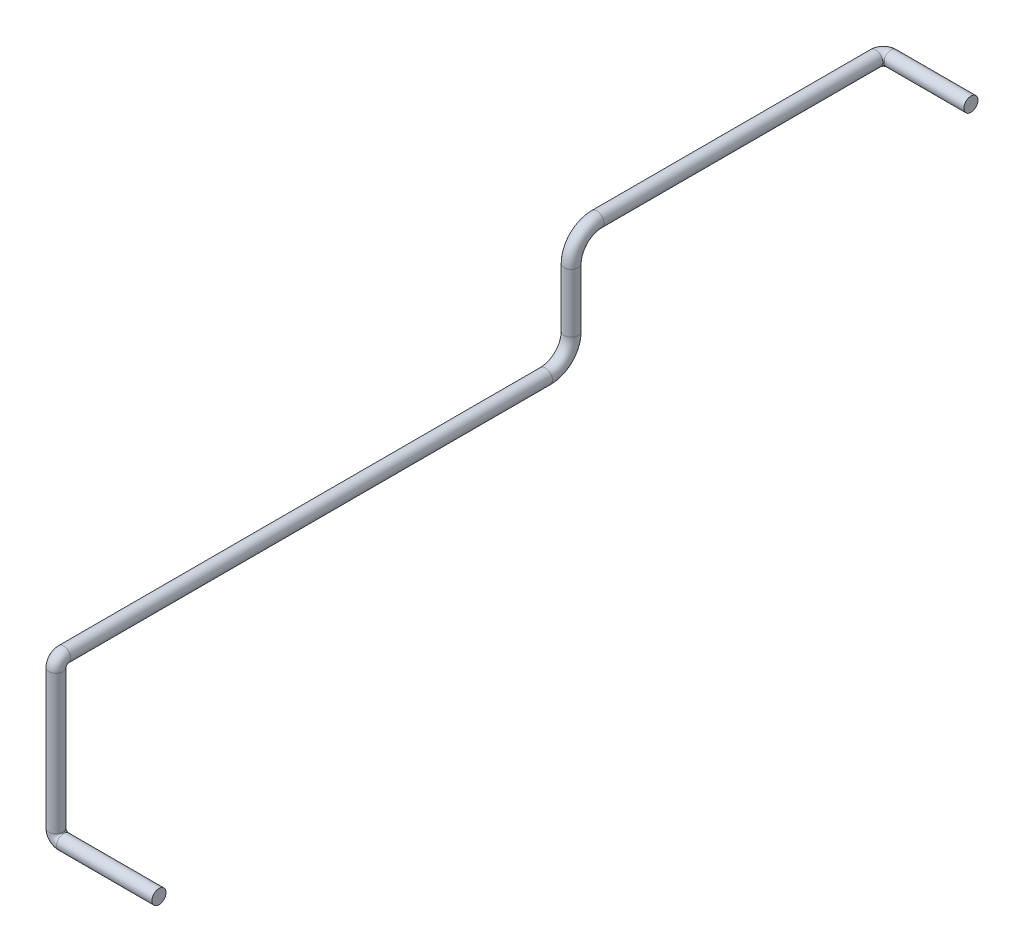
ISO-10303-21;
HEADER;
FILE_DESCRIPTION(('STEP AP214'),'2;1');
FILE_NAME('part.step','',(''),(''),'','','');
FILE_SCHEMA(('AUTOMOTIVE_DESIGN { 1 0 10303 214 1 1 1 1 }'));
ENDSEC;
DATA;
#1=APPLICATION_CONTEXT('core data for automotive mechanical design processes');
#2=APPLICATION_PROTOCOL_DEFINITION('international standard','automotive_design',2000,#1);
#3=PRODUCT_CONTEXT('',#1,'mechanical');
#4=PRODUCT('Part','Part','',(#3));
#5=PRODUCT_RELATED_PRODUCT_CATEGORY('part','',(#4));
#6=PRODUCT_DEFINITION_FORMATION('','',#4);
#7=PRODUCT_DEFINITION_CONTEXT('part definition',#1,'design');
#8=PRODUCT_DEFINITION('design','',#6,#7);
#9=PRODUCT_DEFINITION_SHAPE('','',#8);
#10=(LENGTH_UNIT() NAMED_UNIT(*) SI_UNIT(.MILLI.,.METRE.));
#11=(NAMED_UNIT(*) PLANE_ANGLE_UNIT() SI_UNIT($,.RADIAN.));
#12=(NAMED_UNIT(*) SI_UNIT($,.STERADIAN.) SOLID_ANGLE_UNIT());
#13=UNCERTAINTY_MEASURE_WITH_UNIT(LENGTH_MEASURE(1.E-05),#10,'distance_accuracy_value','');
#14=(GEOMETRIC_REPRESENTATION_CONTEXT(3) GLOBAL_UNCERTAINTY_ASSIGNED_CONTEXT((#13)) GLOBAL_UNIT_ASSIGNED_CONTEXT((#10,
#11,#12)) REPRESENTATION_CONTEXT('',''));
#15=CARTESIAN_POINT('',(0.,0.,0.));
#16=DIRECTION('',(0.,0.,1.));
#17=DIRECTION('',(1.,0.,0.));
#18=AXIS2_PLACEMENT_3D('',#15,#16,#17);
#19=CARTESIAN_POINT('',(0.,0.,0.));
#20=DIRECTION('',(1.,0.,0.));
#21=DIRECTION('',(0.,0.,-1.));
#22=AXIS2_PLACEMENT_3D('',#19,#20,#21);
#23=PLANE('',#22);
#24=CARTESIAN_POINT('',(0.,0.,0.));
#25=DIRECTION('',(1.,0.,0.));
#26=DIRECTION('',(0.,0.,-1.));
#27=AXIS2_PLACEMENT_3D('',#24,#25,#26);
#28=CIRCLE('',#27,13.7);
#29=CARTESIAN_POINT('',(0.,0.,-13.7));
#30=VERTEX_POINT('',#29);
#31=EDGE_CURVE('E49',#30,#30,#28,.T.);
#32=ORIENTED_EDGE('',*,*,#31,.T.);
#33=EDGE_LOOP('',(#32));
#34=FACE_BOUND('',#33,.T.);
#35=ADVANCED_FACE('F37',(#34),#23,.T.);
#36=CARTESIAN_POINT('',(-29.9999999999999,514.000000000001,-1606.));
#37=DIRECTION('',(-1.,0.,0.));
#38=DIRECTION('',(0.,-1.,0.));
#39=AXIS2_PLACEMENT_3D('',#36,#37,#38);
#40=PLANE('',#39);
#41=CARTESIAN_POINT('',(-29.9999999999999,514.000000000001,-1606.));
#42=DIRECTION('',(-1.,0.,0.));
#43=DIRECTION('',(0.,-1.,0.));
#44=AXIS2_PLACEMENT_3D('',#41,#42,#43);
#45=CIRCLE('',#44,13.7);
#46=CARTESIAN_POINT('',(-29.9999999999999,500.300000000001,-1606.));
#47=VERTEX_POINT('',#46);
#48=EDGE_CURVE('E11',#47,#47,#45,.T.);
#49=ORIENTED_EDGE('',*,*,#48,.F.);
#50=EDGE_LOOP('',(#49));
#51=FACE_BOUND('',#50,.T.);
#52=ADVANCED_FACE('F55',(#51),#40,.F.);
#53=CARTESIAN_POINT('',(0.,0.,0.));
#54=DIRECTION('',(-1.,0.,0.));
#55=DIRECTION('',(0.,0.,1.));
#56=AXIS2_PLACEMENT_3D('',#53,#54,#55);
#57=CYLINDRICAL_SURFACE('',#56,13.7);
#58=CARTESIAN_POINT('',(-185.,0.,0.));
#59=DIRECTION('',(1.,0.,0.));
#60=DIRECTION('',(0.,0.,-1.));
#61=AXIS2_PLACEMENT_3D('',#58,#59,#60);
#62=CIRCLE('',#61,13.7);
#63=CARTESIAN_POINT('',(-185.,-13.7,0.));
#64=VERTEX_POINT('',#63);
#65=EDGE_CURVE('E113',#64,#64,#62,.T.);
#66=ORIENTED_EDGE('',*,*,#65,.T.);
#67=EDGE_LOOP('',(#66));
#68=FACE_BOUND('',#67,.T.);
#69=ORIENTED_EDGE('',*,*,#31,.F.);
#70=EDGE_LOOP('',(#69));
#71=FACE_BOUND('',#70,.T.);
#72=ADVANCED_FACE('F57',(#68,#71),#57,.T.);
#73=CARTESIAN_POINT('',(-185.,15.,0.));
#74=DIRECTION('',(0.,0.,-1.));
#75=DIRECTION('',(-1.,0.,0.));
#76=AXIS2_PLACEMENT_3D('',#73,#74,#75);
#77=TOROIDAL_SURFACE('',#76,15.,13.7);
#78=CARTESIAN_POINT('',(-200.,15.,0.));
#79=DIRECTION('',(0.,-1.,0.));
#80=DIRECTION('',(0.,0.,-1.));
#81=AXIS2_PLACEMENT_3D('',#78,#79,#80);
#82=CIRCLE('',#81,13.7);
#83=CARTESIAN_POINT('',(-213.7,15.,0.));
#84=VERTEX_POINT('',#83);
#85=EDGE_CURVE('E110',#84,#84,#82,.T.);
#86=CARTESIAN_POINT('',(-185.,15.,0.));
#87=DIRECTION('',(0.,0.,-1.));
#88=DIRECTION('',(-1.,0.,0.));
#89=AXIS2_PLACEMENT_3D('',#86,#87,#88);
#90=CIRCLE('',#89,28.7);
#91=EDGE_CURVE('',#64,#84,#90,.T.);
#92=ORIENTED_EDGE('',*,*,#65,.F.);
#93=ORIENTED_EDGE('',*,*,#85,.T.);
#94=ORIENTED_EDGE('',*,*,#91,.T.);
#95=ORIENTED_EDGE('',*,*,#91,.F.);
#96=EDGE_LOOP('',(#92,#94,#93,#95));
#97=FACE_BOUND('',#96,.T.);
#98=ADVANCED_FACE('F62',(#97),#77,.T.);
#99=CARTESIAN_POINT('',(-200.,15.,0.));
#100=DIRECTION('',(0.,1.,0.));
#101=DIRECTION('',(0.,0.,1.));
#102=AXIS2_PLACEMENT_3D('',#99,#100,#101);
#103=CYLINDRICAL_SURFACE('',#102,13.7);
#104=CARTESIAN_POINT('',(-200.,285.,0.));
#105=DIRECTION('',(0.,-1.,0.));
#106=DIRECTION('',(0.,0.,-1.));
#107=AXIS2_PLACEMENT_3D('',#104,#105,#106);
#108=CIRCLE('',#107,13.7);
#109=CARTESIAN_POINT('',(-200.,285.,13.7));
#110=VERTEX_POINT('',#109);
#111=EDGE_CURVE('E115',#110,#110,#108,.T.);
#112=ORIENTED_EDGE('',*,*,#111,.T.);
#113=EDGE_LOOP('',(#112));
#114=FACE_BOUND('',#113,.T.);
#115=ORIENTED_EDGE('',*,*,#85,.F.);
#116=EDGE_LOOP('',(#115));
#117=FACE_BOUND('',#116,.T.);
#118=ADVANCED_FACE('F98',(#114,#117),#103,.T.);
#119=CARTESIAN_POINT('',(-200.,285.,-15.));
#120=DIRECTION('',(-1.,0.,0.));
#121=DIRECTION('',(0.,0.,1.));
#122=AXIS2_PLACEMENT_3D('',#119,#120,#121);
#123=TOROIDAL_SURFACE('',#122,15.,13.7);
#124=CARTESIAN_POINT('',(-200.,300.,-15.));
#125=DIRECTION('',(0.,0.,1.));
#126=DIRECTION('',(0.,-1.,0.));
#127=AXIS2_PLACEMENT_3D('',#124,#125,#126);
#128=CIRCLE('',#127,13.7);
#129=CARTESIAN_POINT('',(-200.,313.7,-15.));
#130=VERTEX_POINT('',#129);
#131=EDGE_CURVE('E121',#130,#130,#128,.T.);
#132=CARTESIAN_POINT('',(-200.,285.,-15.));
#133=DIRECTION('',(-1.,0.,0.));
#134=DIRECTION('',(0.,0.,1.));
#135=AXIS2_PLACEMENT_3D('',#132,#133,#134);
#136=CIRCLE('',#135,28.7);
#137=EDGE_CURVE('',#110,#130,#136,.T.);
#138=ORIENTED_EDGE('',*,*,#111,.F.);
#139=ORIENTED_EDGE('',*,*,#131,.T.);
#140=ORIENTED_EDGE('',*,*,#137,.T.);
#141=ORIENTED_EDGE('',*,*,#137,.F.);
#142=EDGE_LOOP('',(#138,#140,#139,#141));
#143=FACE_BOUND('',#142,.T.);
#144=ADVANCED_FACE('F94',(#143),#123,.T.);
#145=CARTESIAN_POINT('',(-200.,300.,-15.));
#146=DIRECTION('',(0.,0.,-1.));
#147=DIRECTION('',(0.,1.,0.));
#148=AXIS2_PLACEMENT_3D('',#145,#146,#147);
#149=CYLINDRICAL_SURFACE('',#148,13.7);
#150=CARTESIAN_POINT('',(-200.,300.,-950.));
#151=DIRECTION('',(0.,0.,1.));
#152=DIRECTION('',(0.,-1.,0.));
#153=AXIS2_PLACEMENT_3D('',#150,#151,#152);
#154=CIRCLE('',#153,13.7);
#155=CARTESIAN_POINT('',(-200.,286.3,-950.));
#156=VERTEX_POINT('',#155);
#157=EDGE_CURVE('E124',#156,#156,#154,.T.);
#158=ORIENTED_EDGE('',*,*,#157,.T.);
#159=EDGE_LOOP('',(#158));
#160=FACE_BOUND('',#159,.T.);
#161=ORIENTED_EDGE('',*,*,#131,.F.);
#162=EDGE_LOOP('',(#161));
#163=FACE_BOUND('',#162,.T.);
#164=ADVANCED_FACE('F90',(#160,#163),#149,.T.);
#165=CARTESIAN_POINT('',(-200.,350.,-950.));
#166=DIRECTION('',(1.,0.,0.));
#167=DIRECTION('',(0.,0.,-1.));
#168=AXIS2_PLACEMENT_3D('',#165,#166,#167);
#169=TOROIDAL_SURFACE('',#168,50.,13.7);
#170=CARTESIAN_POINT('',(-200.,350.,-1000.));
#171=DIRECTION('',(0.,-1.,0.));
#172=DIRECTION('',(0.,0.,-1.));
#173=AXIS2_PLACEMENT_3D('',#170,#171,#172);
#174=CIRCLE('',#173,13.7);
#175=CARTESIAN_POINT('',(-200.,350.,-1013.7));
#176=VERTEX_POINT('',#175);
#177=EDGE_CURVE('E127',#176,#176,#174,.T.);
#178=CARTESIAN_POINT('',(-200.,350.,-950.));
#179=DIRECTION('',(1.,0.,0.));
#180=DIRECTION('',(0.,0.,-1.));
#181=AXIS2_PLACEMENT_3D('',#178,#179,#180);
#182=CIRCLE('',#181,63.7);
#183=EDGE_CURVE('',#156,#176,#182,.T.);
#184=ORIENTED_EDGE('',*,*,#157,.F.);
#185=ORIENTED_EDGE('',*,*,#177,.T.);
#186=ORIENTED_EDGE('',*,*,#183,.T.);
#187=ORIENTED_EDGE('',*,*,#183,.F.);
#188=EDGE_LOOP('',(#184,#186,#185,#187));
#189=FACE_BOUND('',#188,.T.);
#190=ADVANCED_FACE('F86',(#189),#169,.T.);
#191=CARTESIAN_POINT('',(-200.,350.,-1000.));
#192=DIRECTION('',(0.,1.,0.));
#193=DIRECTION('',(0.,0.,1.));
#194=AXIS2_PLACEMENT_3D('',#191,#192,#193);
#195=CYLINDRICAL_SURFACE('',#194,13.7);
#196=CARTESIAN_POINT('',(-200.,464.,-1000.));
#197=DIRECTION('',(0.,-1.,0.));
#198=DIRECTION('',(0.,0.,-1.));
#199=AXIS2_PLACEMENT_3D('',#196,#197,#198);
#200=CIRCLE('',#199,13.7);
#201=CARTESIAN_POINT('',(-200.,464.,-986.3));
#202=VERTEX_POINT('',#201);
#203=EDGE_CURVE('E130',#202,#202,#200,.T.);
#204=ORIENTED_EDGE('',*,*,#203,.T.);
#205=EDGE_LOOP('',(#204));
#206=FACE_BOUND('',#205,.T.);
#207=ORIENTED_EDGE('',*,*,#177,.F.);
#208=EDGE_LOOP('',(#207));
#209=FACE_BOUND('',#208,.T.);
#210=ADVANCED_FACE('F82',(#206,#209),#195,.T.);
#211=CARTESIAN_POINT('',(-200.,464.,-1050.));
#212=DIRECTION('',(-1.,0.,0.));
#213=DIRECTION('',(0.,0.,1.));
#214=AXIS2_PLACEMENT_3D('',#211,#212,#213);
#215=TOROIDAL_SURFACE('',#214,50.,13.7);
#216=CARTESIAN_POINT('',(-200.,514.,-1050.));
#217=DIRECTION('',(0.,0.,1.));
#218=DIRECTION('',(0.,-1.,0.));
#219=AXIS2_PLACEMENT_3D('',#216,#217,#218);
#220=CIRCLE('',#219,13.7);
#221=CARTESIAN_POINT('',(-200.,527.7,-1050.));
#222=VERTEX_POINT('',#221);
#223=EDGE_CURVE('E133',#222,#222,#220,.T.);
#224=CARTESIAN_POINT('',(-200.,464.,-1050.));
#225=DIRECTION('',(-1.,0.,0.));
#226=DIRECTION('',(0.,0.,1.));
#227=AXIS2_PLACEMENT_3D('',#224,#225,#226);
#228=CIRCLE('',#227,63.7);
#229=EDGE_CURVE('',#202,#222,#228,.T.);
#230=ORIENTED_EDGE('',*,*,#203,.F.);
#231=ORIENTED_EDGE('',*,*,#223,.T.);
#232=ORIENTED_EDGE('',*,*,#229,.T.);
#233=ORIENTED_EDGE('',*,*,#229,.F.);
#234=EDGE_LOOP('',(#230,#232,#231,#233));
#235=FACE_BOUND('',#234,.T.);
#236=ADVANCED_FACE('F78',(#235),#215,.T.);
#237=CARTESIAN_POINT('',(-200.,514.,-1050.));
#238=DIRECTION('',(0.,0.,-1.));
#239=DIRECTION('',(0.,1.,0.));
#240=AXIS2_PLACEMENT_3D('',#237,#238,#239);
#241=CYLINDRICAL_SURFACE('',#240,13.7);
#242=CARTESIAN_POINT('',(-200.,514.000000000001,-1591.));
#243=DIRECTION('',(0.,0.,1.));
#244=DIRECTION('',(0.,-1.,0.));
#245=AXIS2_PLACEMENT_3D('',#242,#243,#244);
#246=CIRCLE('',#245,13.7);
#247=CARTESIAN_POINT('',(-213.7,514.000000000001,-1591.));
#248=VERTEX_POINT('',#247);
#249=EDGE_CURVE('E136',#248,#248,#246,.T.);
#250=ORIENTED_EDGE('',*,*,#249,.T.);
#251=EDGE_LOOP('',(#250));
#252=FACE_BOUND('',#251,.T.);
#253=ORIENTED_EDGE('',*,*,#223,.F.);
#254=EDGE_LOOP('',(#253));
#255=FACE_BOUND('',#254,.T.);
#256=ADVANCED_FACE('F72',(#252,#255),#241,.T.);
#257=CARTESIAN_POINT('',(-185.,514.,-1591.));
#258=DIRECTION('',(0.,-1.,0.));
#259=DIRECTION('',(0.,0.,-1.));
#260=AXIS2_PLACEMENT_3D('',#257,#258,#259);
#261=TOROIDAL_SURFACE('',#260,14.9999999999999,13.7);
#262=CARTESIAN_POINT('',(-185.,514.,-1606.));
#263=DIRECTION('',(-1.,0.,0.));
#264=DIRECTION('',(0.,-1.,0.));
#265=AXIS2_PLACEMENT_3D('',#262,#263,#264);
#266=CIRCLE('',#265,13.7);
#267=CARTESIAN_POINT('',(-185.,514.,-1619.7));
#268=VERTEX_POINT('',#267);
#269=EDGE_CURVE('E44',#268,#268,#266,.T.);
#270=CARTESIAN_POINT('',(-185.,514.,-1591.));
#271=DIRECTION('',(0.,-1.,0.));
#272=DIRECTION('',(0.,0.,-1.));
#273=AXIS2_PLACEMENT_3D('',#270,#271,#272);
#274=CIRCLE('',#273,28.6999999999999);
#275=EDGE_CURVE('',#248,#268,#274,.T.);
#276=ORIENTED_EDGE('',*,*,#249,.F.);
#277=ORIENTED_EDGE('',*,*,#269,.T.);
#278=ORIENTED_EDGE('',*,*,#275,.T.);
#279=ORIENTED_EDGE('',*,*,#275,.F.);
#280=EDGE_LOOP('',(#276,#278,#277,#279));
#281=FACE_BOUND('',#280,.T.);
#282=ADVANCED_FACE('F68',(#281),#261,.T.);
#283=CARTESIAN_POINT('',(-185.,514.000000000001,-1606.));
#284=DIRECTION('',(1.,0.,0.));
#285=DIRECTION('',(0.,1.,0.));
#286=AXIS2_PLACEMENT_3D('',#283,#284,#285);
#287=CYLINDRICAL_SURFACE('',#286,13.7);
#288=ORIENTED_EDGE('',*,*,#48,.T.);
#289=EDGE_LOOP('',(#288));
#290=FACE_BOUND('',#289,.T.);
#291=ORIENTED_EDGE('',*,*,#269,.F.);
#292=EDGE_LOOP('',(#291));
#293=FACE_BOUND('',#292,.T.);
#294=ADVANCED_FACE('F52',(#290,#293),#287,.T.);
#295=CLOSED_SHELL('',(#35,#52,#72,#98,#118,#144,#164,#190,#210,#236,#256,#282,#294));
#296=MANIFOLD_SOLID_BREP('B2',#295);
#297=ADVANCED_BREP_SHAPE_REPRESENTATION('',(#18,#296),#14);
#298=SHAPE_DEFINITION_REPRESENTATION(#9,#297);
ENDSEC;
END-ISO-10303-21;
